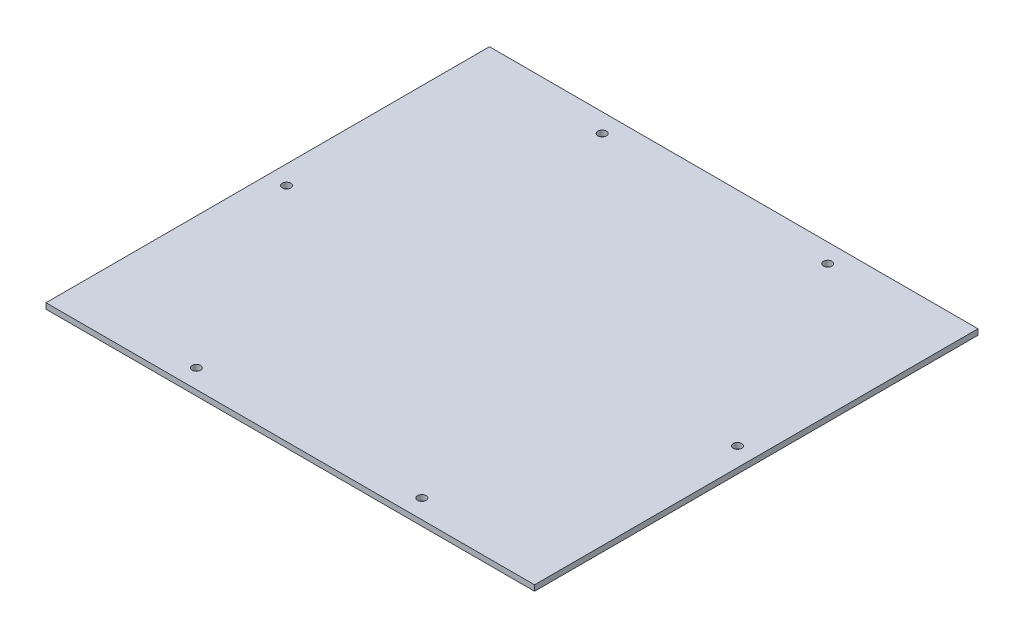
ISO-10303-21;
HEADER;
FILE_DESCRIPTION(('STEP AP214'),'2;1');
FILE_NAME('part.step','',(''),(''),'','','');
FILE_SCHEMA(('AUTOMOTIVE_DESIGN { 1 0 10303 214 1 1 1 1 }'));
ENDSEC;
DATA;
#1=APPLICATION_CONTEXT('core data for automotive mechanical design processes');
#2=APPLICATION_PROTOCOL_DEFINITION('international standard','automotive_design',2000,#1);
#3=PRODUCT_CONTEXT('',#1,'mechanical');
#4=PRODUCT('Part','Part','',(#3));
#5=PRODUCT_RELATED_PRODUCT_CATEGORY('part','',(#4));
#6=PRODUCT_DEFINITION_FORMATION('','',#4);
#7=PRODUCT_DEFINITION_CONTEXT('part definition',#1,'design');
#8=PRODUCT_DEFINITION('design','',#6,#7);
#9=PRODUCT_DEFINITION_SHAPE('','',#8);
#10=(LENGTH_UNIT() NAMED_UNIT(*) SI_UNIT(.MILLI.,.METRE.));
#11=(NAMED_UNIT(*) PLANE_ANGLE_UNIT() SI_UNIT($,.RADIAN.));
#12=(NAMED_UNIT(*) SI_UNIT($,.STERADIAN.) SOLID_ANGLE_UNIT());
#13=UNCERTAINTY_MEASURE_WITH_UNIT(LENGTH_MEASURE(1.E-05),#10,'distance_accuracy_value','');
#14=(GEOMETRIC_REPRESENTATION_CONTEXT(3) GLOBAL_UNCERTAINTY_ASSIGNED_CONTEXT((#13)) GLOBAL_UNIT_ASSIGNED_CONTEXT((#10,
#11,#12)) REPRESENTATION_CONTEXT('',''));
#15=CARTESIAN_POINT('',(0.,0.,0.));
#16=DIRECTION('',(0.,0.,1.));
#17=DIRECTION('',(1.,0.,0.));
#18=AXIS2_PLACEMENT_3D('',#15,#16,#17);
#19=CARTESIAN_POINT('',(-224.330876849042,33.000000000021,0.0645096813482755));
#20=DIRECTION('',(1.,0.,0.));
#21=DIRECTION('',(0.,0.,-1.));
#22=AXIS2_PLACEMENT_3D('',#19,#20,#21);
#23=PLANE('',#22);
#24=DIRECTION('',(0.,0.,1.));
#25=VECTOR('',#24,1.);
#26=CARTESIAN_POINT('',(-224.330876849042,30.000000000021,0.0645096813482755));
#27=LINE('',#26,#25);
#28=CARTESIAN_POINT('',(-224.330876849042,30.000000000021,0.0645096813482755));
#29=VERTEX_POINT('',#28);
#30=CARTESIAN_POINT('',(-224.330876849042,30.000000000021,236.064509681348));
#31=VERTEX_POINT('',#30);
#32=EDGE_CURVE('E97',#29,#31,#27,.T.);
#33=ORIENTED_EDGE('',*,*,#32,.T.);
#34=DIRECTION('',(0.,-1.,0.));
#35=VECTOR('',#34,1.);
#36=CARTESIAN_POINT('',(-224.330876849042,33.000000000021,236.064509681348));
#37=LINE('',#36,#35);
#38=CARTESIAN_POINT('',(-224.330876849042,33.000000000021,236.064509681348));
#39=VERTEX_POINT('',#38);
#40=EDGE_CURVE('E11',#39,#31,#37,.T.);
#41=ORIENTED_EDGE('',*,*,#40,.F.);
#42=DIRECTION('',(0.,0.,1.));
#43=VECTOR('',#42,1.);
#44=CARTESIAN_POINT('',(-224.330876849042,33.000000000021,0.0645096813482755));
#45=LINE('',#44,#43);
#46=CARTESIAN_POINT('',(-224.330876849042,33.000000000021,0.0645096813482755));
#47=VERTEX_POINT('',#46);
#48=EDGE_CURVE('E85',#47,#39,#45,.T.);
#49=ORIENTED_EDGE('',*,*,#48,.F.);
#50=DIRECTION('',(0.,-1.,0.));
#51=VECTOR('',#50,1.);
#52=CARTESIAN_POINT('',(-224.330876849042,33.000000000021,0.0645096813482755));
#53=LINE('',#52,#51);
#54=EDGE_CURVE('E93',#47,#29,#53,.T.);
#55=ORIENTED_EDGE('',*,*,#54,.T.);
#56=EDGE_LOOP('',(#33,#41,#49,#55));
#57=FACE_BOUND('',#56,.T.);
#58=ADVANCED_FACE('F34',(#57),#23,.F.);
#59=CARTESIAN_POINT('',(-224.330876849042,33.000000000021,236.064509681348));
#60=DIRECTION('',(0.,0.,-1.));
#61=DIRECTION('',(-1.,0.,0.));
#62=AXIS2_PLACEMENT_3D('',#59,#60,#61);
#63=PLANE('',#62);
#64=DIRECTION('',(1.,0.,0.));
#65=VECTOR('',#64,1.);
#66=CARTESIAN_POINT('',(-224.330876849042,30.000000000021,236.064509681348));
#67=LINE('',#66,#65);
#68=CARTESIAN_POINT('',(35.6691231509583,30.000000000021,236.064509681348));
#69=VERTEX_POINT('',#68);
#70=EDGE_CURVE('E89',#31,#69,#67,.T.);
#71=ORIENTED_EDGE('',*,*,#70,.T.);
#72=DIRECTION('',(0.,-1.,0.));
#73=VECTOR('',#72,1.);
#74=CARTESIAN_POINT('',(35.6691231509583,33.000000000021,236.064509681348));
#75=LINE('',#74,#73);
#76=CARTESIAN_POINT('',(35.6691231509583,33.000000000021,236.064509681348));
#77=VERTEX_POINT('',#76);
#78=EDGE_CURVE('E42',#77,#69,#75,.T.);
#79=ORIENTED_EDGE('',*,*,#78,.F.);
#80=DIRECTION('',(1.,0.,0.));
#81=VECTOR('',#80,1.);
#82=CARTESIAN_POINT('',(-224.330876849042,33.000000000021,236.064509681348));
#83=LINE('',#82,#81);
#84=EDGE_CURVE('E80',#39,#77,#83,.T.);
#85=ORIENTED_EDGE('',*,*,#84,.F.);
#86=ORIENTED_EDGE('',*,*,#40,.T.);
#87=EDGE_LOOP('',(#71,#79,#85,#86));
#88=FACE_BOUND('',#87,.T.);
#89=ADVANCED_FACE('F88',(#88),#63,.F.);
#90=CARTESIAN_POINT('',(35.6691231509583,33.000000000021,0.0645096813494273));
#91=DIRECTION('',(-1.,0.,0.));
#92=DIRECTION('',(0.,0.,1.));
#93=AXIS2_PLACEMENT_3D('',#90,#91,#92);
#94=PLANE('',#93);
#95=DIRECTION('',(0.,0.,-1.));
#96=VECTOR('',#95,1.);
#97=CARTESIAN_POINT('',(35.6691231509583,30.000000000021,0.0645096813494273));
#98=LINE('',#97,#96);
#99=CARTESIAN_POINT('',(35.6691231509583,30.000000000021,0.0645096813494273));
#100=VERTEX_POINT('',#99);
#101=EDGE_CURVE('E67',#69,#100,#98,.T.);
#102=ORIENTED_EDGE('',*,*,#101,.T.);
#103=DIRECTION('',(0.,-1.,0.));
#104=VECTOR('',#103,1.);
#105=CARTESIAN_POINT('',(35.6691231509583,33.000000000021,0.0645096813494273));
#106=LINE('',#105,#104);
#107=CARTESIAN_POINT('',(35.6691231509583,33.000000000021,0.0645096813494273));
#108=VERTEX_POINT('',#107);
#109=EDGE_CURVE('E90',#108,#100,#106,.T.);
#110=ORIENTED_EDGE('',*,*,#109,.F.);
#111=DIRECTION('',(0.,0.,-1.));
#112=VECTOR('',#111,1.);
#113=CARTESIAN_POINT('',(35.6691231509583,33.000000000021,0.0645096813494273));
#114=LINE('',#113,#112);
#115=EDGE_CURVE('E83',#77,#108,#114,.T.);
#116=ORIENTED_EDGE('',*,*,#115,.F.);
#117=ORIENTED_EDGE('',*,*,#78,.T.);
#118=EDGE_LOOP('',(#102,#110,#116,#117));
#119=FACE_BOUND('',#118,.T.);
#120=ADVANCED_FACE('F91',(#119),#94,.F.);
#121=CARTESIAN_POINT('',(-224.330876849042,33.000000000021,0.0645096813482755));
#122=DIRECTION('',(0.,0.,1.));
#123=DIRECTION('',(1.,0.,0.));
#124=AXIS2_PLACEMENT_3D('',#121,#122,#123);
#125=PLANE('',#124);
#126=DIRECTION('',(-1.,0.,0.));
#127=VECTOR('',#126,1.);
#128=CARTESIAN_POINT('',(-224.330876849042,30.000000000021,0.0645096813482755));
#129=LINE('',#128,#127);
#130=EDGE_CURVE('E73',#100,#29,#129,.T.);
#131=ORIENTED_EDGE('',*,*,#130,.T.);
#132=ORIENTED_EDGE('',*,*,#54,.F.);
#133=DIRECTION('',(-1.,0.,0.));
#134=VECTOR('',#133,1.);
#135=CARTESIAN_POINT('',(-224.330876849042,33.000000000021,0.0645096813482755));
#136=LINE('',#135,#134);
#137=EDGE_CURVE('E50',#108,#47,#136,.T.);
#138=ORIENTED_EDGE('',*,*,#137,.F.);
#139=ORIENTED_EDGE('',*,*,#109,.T.);
#140=EDGE_LOOP('',(#131,#132,#138,#139));
#141=FACE_BOUND('',#140,.T.);
#142=ADVANCED_FACE('F105',(#141),#125,.F.);
#143=CARTESIAN_POINT('',(0.,33.000000000021,0.));
#144=DIRECTION('',(0.,1.,0.));
#145=DIRECTION('',(0.,0.,1.));
#146=AXIS2_PLACEMENT_3D('',#143,#144,#145);
#147=PLANE('',#146);
#148=CARTESIAN_POINT('',(25.6691231509583,33.000000000021,118.064509681349));
#149=DIRECTION('',(0.,1.,0.));
#150=DIRECTION('',(0.,0.,1.));
#151=AXIS2_PLACEMENT_3D('',#148,#149,#150);
#152=CIRCLE('',#151,2.25);
#153=CARTESIAN_POINT('',(25.6691231509583,33.000000000021,120.314509681349));
#154=VERTEX_POINT('',#153);
#155=EDGE_CURVE('E141',#154,#154,#152,.T.);
#156=ORIENTED_EDGE('',*,*,#155,.F.);
#157=EDGE_LOOP('',(#156));
#158=FACE_BOUND('',#157,.T.);
#159=CARTESIAN_POINT('',(-34.3308768490417,33.000000000021,226.064509681348));
#160=DIRECTION('',(0.,1.,0.));
#161=DIRECTION('',(0.,0.,1.));
#162=AXIS2_PLACEMENT_3D('',#159,#160,#161);
#163=CIRCLE('',#162,2.25);
#164=CARTESIAN_POINT('',(-34.3308768490417,33.000000000021,228.314509681348));
#165=VERTEX_POINT('',#164);
#166=EDGE_CURVE('E135',#165,#165,#163,.T.);
#167=ORIENTED_EDGE('',*,*,#166,.F.);
#168=EDGE_LOOP('',(#167));
#169=FACE_BOUND('',#168,.T.);
#170=CARTESIAN_POINT('',(-154.330876849042,33.000000000021,226.064509681348));
#171=DIRECTION('',(0.,1.,0.));
#172=DIRECTION('',(0.,0.,1.));
#173=AXIS2_PLACEMENT_3D('',#170,#171,#172);
#174=CIRCLE('',#173,2.24999999999995);
#175=CARTESIAN_POINT('',(-154.330876849042,33.000000000021,228.314509681348));
#176=VERTEX_POINT('',#175);
#177=EDGE_CURVE('E129',#176,#176,#174,.T.);
#178=ORIENTED_EDGE('',*,*,#177,.F.);
#179=EDGE_LOOP('',(#178));
#180=FACE_BOUND('',#179,.T.);
#181=CARTESIAN_POINT('',(-34.3308768490417,33.000000000021,10.0645096813494));
#182=DIRECTION('',(0.,1.,0.));
#183=DIRECTION('',(0.,0.,1.));
#184=AXIS2_PLACEMENT_3D('',#181,#182,#183);
#185=CIRCLE('',#184,2.25);
#186=CARTESIAN_POINT('',(-34.3308768490417,33.000000000021,12.3145096813494));
#187=VERTEX_POINT('',#186);
#188=EDGE_CURVE('E123',#187,#187,#185,.T.);
#189=ORIENTED_EDGE('',*,*,#188,.F.);
#190=EDGE_LOOP('',(#189));
#191=FACE_BOUND('',#190,.T.);
#192=CARTESIAN_POINT('',(-154.330876849042,33.000000000021,10.0645096813494));
#193=DIRECTION('',(0.,1.,0.));
#194=DIRECTION('',(0.,0.,1.));
#195=AXIS2_PLACEMENT_3D('',#192,#193,#194);
#196=CIRCLE('',#195,2.24999999999995);
#197=CARTESIAN_POINT('',(-154.330876849042,33.000000000021,12.3145096813494));
#198=VERTEX_POINT('',#197);
#199=EDGE_CURVE('E117',#198,#198,#196,.T.);
#200=ORIENTED_EDGE('',*,*,#199,.F.);
#201=EDGE_LOOP('',(#200));
#202=FACE_BOUND('',#201,.T.);
#203=CARTESIAN_POINT('',(-214.330876849042,33.000000000021,118.064509681349));
#204=DIRECTION('',(0.,1.,0.));
#205=DIRECTION('',(0.,0.,1.));
#206=AXIS2_PLACEMENT_3D('',#203,#204,#205);
#207=CIRCLE('',#206,2.24999999999995);
#208=CARTESIAN_POINT('',(-214.330876849042,33.000000000021,120.314509681349));
#209=VERTEX_POINT('',#208);
#210=EDGE_CURVE('E111',#209,#209,#207,.T.);
#211=ORIENTED_EDGE('',*,*,#210,.F.);
#212=EDGE_LOOP('',(#211));
#213=FACE_BOUND('',#212,.T.);
#214=ORIENTED_EDGE('',*,*,#48,.T.);
#215=ORIENTED_EDGE('',*,*,#84,.T.);
#216=ORIENTED_EDGE('',*,*,#115,.T.);
#217=ORIENTED_EDGE('',*,*,#137,.T.);
#218=EDGE_LOOP('',(#214,#215,#216,#217));
#219=FACE_BOUND('',#218,.T.);
#220=ADVANCED_FACE('F81',(#158,#169,#180,#191,#202,#213,#219),#147,.T.);
#221=CARTESIAN_POINT('',(0.,30.000000000021,0.));
#222=DIRECTION('',(0.,1.,0.));
#223=DIRECTION('',(0.,0.,1.));
#224=AXIS2_PLACEMENT_3D('',#221,#222,#223);
#225=PLANE('',#224);
#226=CARTESIAN_POINT('',(25.6691231509583,30.000000000021,118.064509681349));
#227=DIRECTION('',(0.,1.,0.));
#228=DIRECTION('',(0.,0.,1.));
#229=AXIS2_PLACEMENT_3D('',#226,#227,#228);
#230=CIRCLE('',#229,2.25);
#231=CARTESIAN_POINT('',(25.6691231509583,30.000000000021,120.314509681349));
#232=VERTEX_POINT('',#231);
#233=EDGE_CURVE('E138',#232,#232,#230,.T.);
#234=ORIENTED_EDGE('',*,*,#233,.T.);
#235=EDGE_LOOP('',(#234));
#236=FACE_BOUND('',#235,.T.);
#237=CARTESIAN_POINT('',(-34.3308768490417,30.000000000021,226.064509681348));
#238=DIRECTION('',(0.,1.,0.));
#239=DIRECTION('',(0.,0.,1.));
#240=AXIS2_PLACEMENT_3D('',#237,#238,#239);
#241=CIRCLE('',#240,2.25);
#242=CARTESIAN_POINT('',(-34.3308768490417,30.000000000021,228.314509681348));
#243=VERTEX_POINT('',#242);
#244=EDGE_CURVE('E132',#243,#243,#241,.T.);
#245=ORIENTED_EDGE('',*,*,#244,.T.);
#246=EDGE_LOOP('',(#245));
#247=FACE_BOUND('',#246,.T.);
#248=CARTESIAN_POINT('',(-154.330876849042,30.000000000021,226.064509681348));
#249=DIRECTION('',(0.,1.,0.));
#250=DIRECTION('',(0.,0.,1.));
#251=AXIS2_PLACEMENT_3D('',#248,#249,#250);
#252=CIRCLE('',#251,2.24999999999995);
#253=CARTESIAN_POINT('',(-154.330876849042,30.000000000021,228.314509681348));
#254=VERTEX_POINT('',#253);
#255=EDGE_CURVE('E126',#254,#254,#252,.T.);
#256=ORIENTED_EDGE('',*,*,#255,.T.);
#257=EDGE_LOOP('',(#256));
#258=FACE_BOUND('',#257,.T.);
#259=CARTESIAN_POINT('',(-34.3308768490417,30.000000000021,10.0645096813494));
#260=DIRECTION('',(0.,1.,0.));
#261=DIRECTION('',(0.,0.,1.));
#262=AXIS2_PLACEMENT_3D('',#259,#260,#261);
#263=CIRCLE('',#262,2.25);
#264=CARTESIAN_POINT('',(-34.3308768490417,30.000000000021,12.3145096813494));
#265=VERTEX_POINT('',#264);
#266=EDGE_CURVE('E120',#265,#265,#263,.T.);
#267=ORIENTED_EDGE('',*,*,#266,.T.);
#268=EDGE_LOOP('',(#267));
#269=FACE_BOUND('',#268,.T.);
#270=CARTESIAN_POINT('',(-154.330876849042,30.000000000021,10.0645096813494));
#271=DIRECTION('',(0.,1.,0.));
#272=DIRECTION('',(0.,0.,1.));
#273=AXIS2_PLACEMENT_3D('',#270,#271,#272);
#274=CIRCLE('',#273,2.24999999999995);
#275=CARTESIAN_POINT('',(-154.330876849042,30.000000000021,12.3145096813494));
#276=VERTEX_POINT('',#275);
#277=EDGE_CURVE('E114',#276,#276,#274,.T.);
#278=ORIENTED_EDGE('',*,*,#277,.T.);
#279=EDGE_LOOP('',(#278));
#280=FACE_BOUND('',#279,.T.);
#281=CARTESIAN_POINT('',(-214.330876849042,30.000000000021,118.064509681349));
#282=DIRECTION('',(0.,1.,0.));
#283=DIRECTION('',(0.,0.,1.));
#284=AXIS2_PLACEMENT_3D('',#281,#282,#283);
#285=CIRCLE('',#284,2.24999999999995);
#286=CARTESIAN_POINT('',(-214.330876849042,30.000000000021,120.314509681349));
#287=VERTEX_POINT('',#286);
#288=EDGE_CURVE('E100',#287,#287,#285,.T.);
#289=ORIENTED_EDGE('',*,*,#288,.T.);
#290=EDGE_LOOP('',(#289));
#291=FACE_BOUND('',#290,.T.);
#292=ORIENTED_EDGE('',*,*,#32,.F.);
#293=ORIENTED_EDGE('',*,*,#130,.F.);
#294=ORIENTED_EDGE('',*,*,#101,.F.);
#295=ORIENTED_EDGE('',*,*,#70,.F.);
#296=EDGE_LOOP('',(#292,#293,#294,#295));
#297=FACE_BOUND('',#296,.T.);
#298=ADVANCED_FACE('F108',(#236,#247,#258,#269,#280,#291,#297),#225,.F.);
#299=CARTESIAN_POINT('',(-214.330876849042,30.000000000021,118.064509681349));
#300=DIRECTION('',(0.,1.,0.));
#301=DIRECTION('',(0.,0.,1.));
#302=AXIS2_PLACEMENT_3D('',#299,#300,#301);
#303=CYLINDRICAL_SURFACE('',#302,2.24999999999995);
#304=ORIENTED_EDGE('',*,*,#288,.F.);
#305=EDGE_LOOP('',(#304));
#306=FACE_BOUND('',#305,.T.);
#307=ORIENTED_EDGE('',*,*,#210,.T.);
#308=EDGE_LOOP('',(#307));
#309=FACE_BOUND('',#308,.T.);
#310=ADVANCED_FACE('F169',(#306,#309),#303,.F.);
#311=CARTESIAN_POINT('',(-154.330876849042,30.000000000021,10.0645096813494));
#312=DIRECTION('',(0.,1.,0.));
#313=DIRECTION('',(0.,0.,1.));
#314=AXIS2_PLACEMENT_3D('',#311,#312,#313);
#315=CYLINDRICAL_SURFACE('',#314,2.24999999999995);
#316=ORIENTED_EDGE('',*,*,#277,.F.);
#317=EDGE_LOOP('',(#316));
#318=FACE_BOUND('',#317,.T.);
#319=ORIENTED_EDGE('',*,*,#199,.T.);
#320=EDGE_LOOP('',(#319));
#321=FACE_BOUND('',#320,.T.);
#322=ADVANCED_FACE('F171',(#318,#321),#315,.F.);
#323=CARTESIAN_POINT('',(-34.3308768490417,30.000000000021,10.0645096813494));
#324=DIRECTION('',(0.,1.,0.));
#325=DIRECTION('',(0.,0.,1.));
#326=AXIS2_PLACEMENT_3D('',#323,#324,#325);
#327=CYLINDRICAL_SURFACE('',#326,2.25);
#328=ORIENTED_EDGE('',*,*,#266,.F.);
#329=EDGE_LOOP('',(#328));
#330=FACE_BOUND('',#329,.T.);
#331=ORIENTED_EDGE('',*,*,#188,.T.);
#332=EDGE_LOOP('',(#331));
#333=FACE_BOUND('',#332,.T.);
#334=ADVANCED_FACE('F178',(#330,#333),#327,.F.);
#335=CARTESIAN_POINT('',(-154.330876849042,30.000000000021,226.064509681348));
#336=DIRECTION('',(0.,1.,0.));
#337=DIRECTION('',(0.,0.,1.));
#338=AXIS2_PLACEMENT_3D('',#335,#336,#337);
#339=CYLINDRICAL_SURFACE('',#338,2.24999999999995);
#340=ORIENTED_EDGE('',*,*,#255,.F.);
#341=EDGE_LOOP('',(#340));
#342=FACE_BOUND('',#341,.T.);
#343=ORIENTED_EDGE('',*,*,#177,.T.);
#344=EDGE_LOOP('',(#343));
#345=FACE_BOUND('',#344,.T.);
#346=ADVANCED_FACE('F224',(#342,#345),#339,.F.);
#347=CARTESIAN_POINT('',(-34.3308768490417,30.000000000021,226.064509681348));
#348=DIRECTION('',(0.,1.,0.));
#349=DIRECTION('',(0.,0.,1.));
#350=AXIS2_PLACEMENT_3D('',#347,#348,#349);
#351=CYLINDRICAL_SURFACE('',#350,2.25);
#352=ORIENTED_EDGE('',*,*,#244,.F.);
#353=EDGE_LOOP('',(#352));
#354=FACE_BOUND('',#353,.T.);
#355=ORIENTED_EDGE('',*,*,#166,.T.);
#356=EDGE_LOOP('',(#355));
#357=FACE_BOUND('',#356,.T.);
#358=ADVANCED_FACE('F152',(#354,#357),#351,.F.);
#359=CARTESIAN_POINT('',(25.6691231509583,30.000000000021,118.064509681349));
#360=DIRECTION('',(0.,1.,0.));
#361=DIRECTION('',(0.,0.,1.));
#362=AXIS2_PLACEMENT_3D('',#359,#360,#361);
#363=CYLINDRICAL_SURFACE('',#362,2.25);
#364=ORIENTED_EDGE('',*,*,#233,.F.);
#365=EDGE_LOOP('',(#364));
#366=FACE_BOUND('',#365,.T.);
#367=ORIENTED_EDGE('',*,*,#155,.T.);
#368=EDGE_LOOP('',(#367));
#369=FACE_BOUND('',#368,.T.);
#370=ADVANCED_FACE('F149',(#366,#369),#363,.F.);
#371=CLOSED_SHELL('',(#58,#89,#120,#142,#220,#298,#310,#322,#334,#346,#358,#370));
#372=MANIFOLD_SOLID_BREP('B2',#371);
#373=ADVANCED_BREP_SHAPE_REPRESENTATION('',(#18,#372),#14);
#374=SHAPE_DEFINITION_REPRESENTATION(#9,#373);
ENDSEC;
END-ISO-10303-21;
